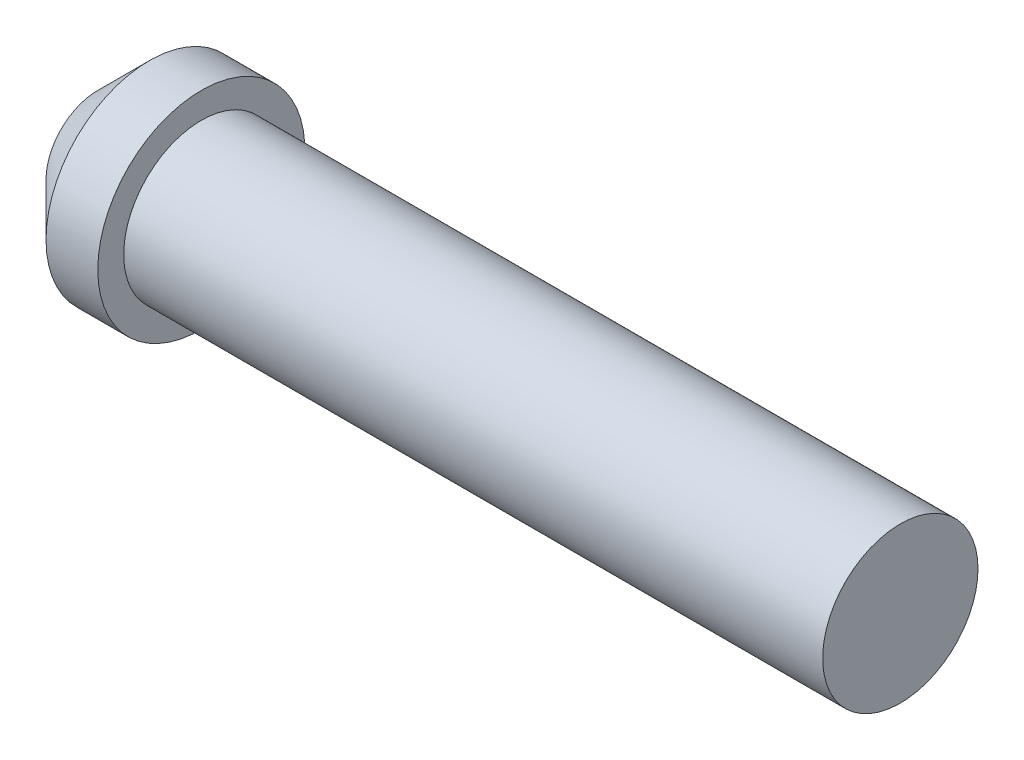
ISO-10303-21;
HEADER;
FILE_DESCRIPTION(('STEP AP214'),'2;1');
FILE_NAME('part.step','',(''),(''),'','','');
FILE_SCHEMA(('AUTOMOTIVE_DESIGN { 1 0 10303 214 1 1 1 1 }'));
ENDSEC;
DATA;
#1=APPLICATION_CONTEXT('core data for automotive mechanical design processes');
#2=APPLICATION_PROTOCOL_DEFINITION('international standard','automotive_design',2000,#1);
#3=PRODUCT_CONTEXT('',#1,'mechanical');
#4=PRODUCT('Part','Part','',(#3));
#5=PRODUCT_RELATED_PRODUCT_CATEGORY('part','',(#4));
#6=PRODUCT_DEFINITION_FORMATION('','',#4);
#7=PRODUCT_DEFINITION_CONTEXT('part definition',#1,'design');
#8=PRODUCT_DEFINITION('design','',#6,#7);
#9=PRODUCT_DEFINITION_SHAPE('','',#8);
#10=(LENGTH_UNIT() NAMED_UNIT(*) SI_UNIT(.MILLI.,.METRE.));
#11=(NAMED_UNIT(*) PLANE_ANGLE_UNIT() SI_UNIT($,.RADIAN.));
#12=(NAMED_UNIT(*) SI_UNIT($,.STERADIAN.) SOLID_ANGLE_UNIT());
#13=UNCERTAINTY_MEASURE_WITH_UNIT(LENGTH_MEASURE(1.E-05),#10,'distance_accuracy_value','');
#14=(GEOMETRIC_REPRESENTATION_CONTEXT(3) GLOBAL_UNCERTAINTY_ASSIGNED_CONTEXT((#13)) GLOBAL_UNIT_ASSIGNED_CONTEXT((#10,
#11,#12)) REPRESENTATION_CONTEXT('',''));
#15=CARTESIAN_POINT('',(0.,0.,0.));
#16=DIRECTION('',(0.,0.,1.));
#17=DIRECTION('',(1.,0.,0.));
#18=AXIS2_PLACEMENT_3D('',#15,#16,#17);
#19=CARTESIAN_POINT('',(27.,0.,0.));
#20=DIRECTION('',(-1.,0.,0.));
#21=DIRECTION('',(0.,0.,1.));
#22=AXIS2_PLACEMENT_3D('',#19,#20,#21);
#23=CYLINDRICAL_SURFACE('',#22,3.);
#24=CARTESIAN_POINT('',(27.,0.,0.));
#25=DIRECTION('',(1.,0.,0.));
#26=DIRECTION('',(0.,0.,-1.));
#27=AXIS2_PLACEMENT_3D('',#24,#25,#26);
#28=CIRCLE('',#27,3.);
#29=CARTESIAN_POINT('',(27.,0.,-3.));
#30=VERTEX_POINT('',#29);
#31=EDGE_CURVE('E50',#30,#30,#28,.T.);
#32=ORIENTED_EDGE('',*,*,#31,.F.);
#33=EDGE_LOOP('',(#32));
#34=FACE_BOUND('',#33,.T.);
#35=CARTESIAN_POINT('',(0.,0.,0.));
#36=DIRECTION('',(1.,0.,0.));
#37=DIRECTION('',(0.,0.,-1.));
#38=AXIS2_PLACEMENT_3D('',#35,#36,#37);
#39=CIRCLE('',#38,3.);
#40=CARTESIAN_POINT('',(0.,0.,-3.));
#41=VERTEX_POINT('',#40);
#42=EDGE_CURVE('E55',#41,#41,#39,.T.);
#43=ORIENTED_EDGE('',*,*,#42,.T.);
#44=EDGE_LOOP('',(#43));
#45=FACE_BOUND('',#44,.T.);
#46=ADVANCED_FACE('F37',(#34,#45),#23,.T.);
#47=CARTESIAN_POINT('',(27.,0.,0.));
#48=DIRECTION('',(1.,0.,0.));
#49=DIRECTION('',(0.,0.,-1.));
#50=AXIS2_PLACEMENT_3D('',#47,#48,#49);
#51=PLANE('',#50);
#52=ORIENTED_EDGE('',*,*,#31,.T.);
#53=EDGE_LOOP('',(#52));
#54=FACE_BOUND('',#53,.T.);
#55=ADVANCED_FACE('F82',(#54),#51,.T.);
#56=CARTESIAN_POINT('',(-4.,0.,0.));
#57=DIRECTION('',(1.,0.,0.));
#58=DIRECTION('',(0.,0.,-1.));
#59=AXIS2_PLACEMENT_3D('',#56,#57,#58);
#60=CYLINDRICAL_SURFACE('',#59,4.);
#61=CARTESIAN_POINT('',(-2.,0.,0.));
#62=DIRECTION('',(-1.,0.,0.));
#63=DIRECTION('',(0.,0.,1.));
#64=AXIS2_PLACEMENT_3D('',#61,#62,#63);
#65=CIRCLE('',#64,4.);
#66=CARTESIAN_POINT('',(-2.,0.,4.));
#67=VERTEX_POINT('',#66);
#68=EDGE_CURVE('E10',#67,#67,#65,.F.);
#69=ORIENTED_EDGE('',*,*,#68,.T.);
#70=EDGE_LOOP('',(#69));
#71=FACE_BOUND('',#70,.T.);
#72=CARTESIAN_POINT('',(0.,0.,0.));
#73=DIRECTION('',(-1.,0.,0.));
#74=DIRECTION('',(0.,0.,1.));
#75=AXIS2_PLACEMENT_3D('',#72,#73,#74);
#76=CIRCLE('',#75,4.);
#77=CARTESIAN_POINT('',(0.,0.,4.));
#78=VERTEX_POINT('',#77);
#79=EDGE_CURVE('E60',#78,#78,#76,.T.);
#80=ORIENTED_EDGE('',*,*,#79,.T.);
#81=EDGE_LOOP('',(#80));
#82=FACE_BOUND('',#81,.T.);
#83=ADVANCED_FACE('F66',(#71,#82),#60,.T.);
#84=CARTESIAN_POINT('',(-4.,0.,0.));
#85=DIRECTION('',(-1.,0.,0.));
#86=DIRECTION('',(0.,0.,1.));
#87=AXIS2_PLACEMENT_3D('',#84,#85,#86);
#88=PLANE('',#87);
#89=CARTESIAN_POINT('',(-4.,0.,0.));
#90=DIRECTION('',(-1.,0.,0.));
#91=DIRECTION('',(0.,0.,1.));
#92=AXIS2_PLACEMENT_3D('',#89,#90,#91);
#93=CIRCLE('',#92,2.00000000000001);
#94=CARTESIAN_POINT('',(-4.,0.,2.00000000000001));
#95=VERTEX_POINT('',#94);
#96=EDGE_CURVE('E45',#95,#95,#93,.T.);
#97=ORIENTED_EDGE('',*,*,#96,.T.);
#98=EDGE_LOOP('',(#97));
#99=FACE_BOUND('',#98,.T.);
#100=ADVANCED_FACE('F70',(#99),#88,.T.);
#101=CARTESIAN_POINT('',(0.,0.,0.));
#102=DIRECTION('',(-1.,0.,0.));
#103=DIRECTION('',(0.,0.,1.));
#104=AXIS2_PLACEMENT_3D('',#101,#102,#103);
#105=PLANE('',#104);
#106=ORIENTED_EDGE('',*,*,#42,.F.);
#107=EDGE_LOOP('',(#106));
#108=FACE_BOUND('',#107,.T.);
#109=ORIENTED_EDGE('',*,*,#79,.F.);
#110=EDGE_LOOP('',(#109));
#111=FACE_BOUND('',#110,.T.);
#112=ADVANCED_FACE('F68',(#108,#111),#105,.F.);
#113=CARTESIAN_POINT('',(-4.,0.,0.));
#114=DIRECTION('',(1.,0.,0.));
#115=DIRECTION('',(0.,0.,-1.));
#116=AXIS2_PLACEMENT_3D('',#113,#114,#115);
#117=CONICAL_SURFACE('',#116,2.00000000000001,0.785398163397446);
#118=ORIENTED_EDGE('',*,*,#68,.F.);
#119=EDGE_LOOP('',(#118));
#120=FACE_BOUND('',#119,.T.);
#121=ORIENTED_EDGE('',*,*,#96,.F.);
#122=EDGE_LOOP('',(#121));
#123=FACE_BOUND('',#122,.T.);
#124=ADVANCED_FACE('F39',(#120,#123),#117,.T.);
#125=CLOSED_SHELL('',(#46,#55,#83,#100,#112,#124));
#126=MANIFOLD_SOLID_BREP('B2',#125);
#127=ADVANCED_BREP_SHAPE_REPRESENTATION('',(#18,#126),#14);
#128=SHAPE_DEFINITION_REPRESENTATION(#9,#127);
ENDSEC;
END-ISO-10303-21;
